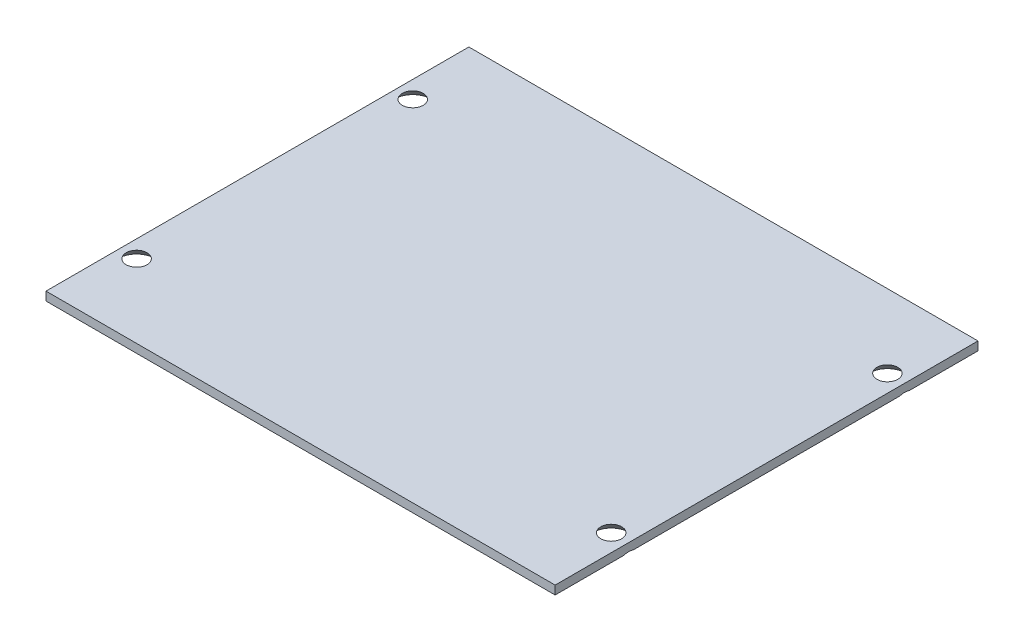
ISO-10303-21;
HEADER;
FILE_DESCRIPTION(('STEP AP214'),'2;1');
FILE_NAME('part.step','',(''),(''),'','','');
FILE_SCHEMA(('AUTOMOTIVE_DESIGN { 1 0 10303 214 1 1 1 1 }'));
ENDSEC;
DATA;
#1=APPLICATION_CONTEXT('core data for automotive mechanical design processes');
#2=APPLICATION_PROTOCOL_DEFINITION('international standard','automotive_design',2000,#1);
#3=PRODUCT_CONTEXT('',#1,'mechanical');
#4=PRODUCT('Part','Part','',(#3));
#5=PRODUCT_RELATED_PRODUCT_CATEGORY('part','',(#4));
#6=PRODUCT_DEFINITION_FORMATION('','',#4);
#7=PRODUCT_DEFINITION_CONTEXT('part definition',#1,'design');
#8=PRODUCT_DEFINITION('design','',#6,#7);
#9=PRODUCT_DEFINITION_SHAPE('','',#8);
#10=(LENGTH_UNIT() NAMED_UNIT(*) SI_UNIT(.MILLI.,.METRE.));
#11=(NAMED_UNIT(*) PLANE_ANGLE_UNIT() SI_UNIT($,.RADIAN.));
#12=(NAMED_UNIT(*) SI_UNIT($,.STERADIAN.) SOLID_ANGLE_UNIT());
#13=UNCERTAINTY_MEASURE_WITH_UNIT(LENGTH_MEASURE(1.E-05),#10,'distance_accuracy_value','');
#14=(GEOMETRIC_REPRESENTATION_CONTEXT(3) GLOBAL_UNCERTAINTY_ASSIGNED_CONTEXT((#13)) GLOBAL_UNIT_ASSIGNED_CONTEXT((#10,
#11,#12)) REPRESENTATION_CONTEXT('',''));
#15=CARTESIAN_POINT('',(0.,0.,0.));
#16=DIRECTION('',(0.,0.,1.));
#17=DIRECTION('',(1.,0.,0.));
#18=AXIS2_PLACEMENT_3D('',#15,#16,#17);
#19=CARTESIAN_POINT('',(0.,1.5875,0.));
#20=DIRECTION('',(0.,1.,0.));
#21=DIRECTION('',(0.,0.,1.));
#22=AXIS2_PLACEMENT_3D('',#19,#20,#21);
#23=PLANE('',#22);
#24=CARTESIAN_POINT('',(43.65625,1.5875,-25.4));
#25=DIRECTION('',(0.,1.,0.));
#26=DIRECTION('',(0.,0.,1.));
#27=AXIS2_PLACEMENT_3D('',#24,#25,#26);
#28=CIRCLE('',#27,1.91909900371674);
#29=CARTESIAN_POINT('',(43.65625,1.5875,-23.4809009962832));
#30=VERTEX_POINT('',#29);
#31=EDGE_CURVE('E109',#30,#30,#28,.T.);
#32=ORIENTED_EDGE('',*,*,#31,.F.);
#33=EDGE_LOOP('',(#32));
#34=FACE_BOUND('',#33,.T.);
#35=CARTESIAN_POINT('',(-43.65625,1.5875,-25.4000000000002));
#36=DIRECTION('',(0.,1.,0.));
#37=DIRECTION('',(0.,0.,1.));
#38=AXIS2_PLACEMENT_3D('',#35,#36,#37);
#39=CIRCLE('',#38,1.91909900371674);
#40=CARTESIAN_POINT('',(-43.65625,1.5875,-23.4809009962834));
#41=VERTEX_POINT('',#40);
#42=EDGE_CURVE('E115',#41,#41,#39,.T.);
#43=ORIENTED_EDGE('',*,*,#42,.F.);
#44=EDGE_LOOP('',(#43));
#45=FACE_BOUND('',#44,.T.);
#46=DIRECTION('',(0.,0.,-1.));
#47=VECTOR('',#46,1.);
#48=CARTESIAN_POINT('',(46.83125,1.5875,-38.89375));
#49=LINE('',#48,#47);
#50=CARTESIAN_POINT('',(46.83125,1.5875,38.89375));
#51=VERTEX_POINT('',#50);
#52=CARTESIAN_POINT('',(46.83125,1.5875,-38.89375));
#53=VERTEX_POINT('',#52);
#54=EDGE_CURVE('E128',#51,#53,#49,.T.);
#55=ORIENTED_EDGE('',*,*,#54,.T.);
#56=DIRECTION('',(-1.,0.,0.));
#57=VECTOR('',#56,1.);
#58=CARTESIAN_POINT('',(-46.83125,1.5875,-38.89375));
#59=LINE('',#58,#57);
#60=CARTESIAN_POINT('',(-46.83125,1.5875,-38.89375));
#61=VERTEX_POINT('',#60);
#62=EDGE_CURVE('E205',#53,#61,#59,.T.);
#63=ORIENTED_EDGE('',*,*,#62,.T.);
#64=DIRECTION('',(0.,0.,1.));
#65=VECTOR('',#64,1.);
#66=CARTESIAN_POINT('',(-46.83125,1.5875,-38.89375));
#67=LINE('',#66,#65);
#68=CARTESIAN_POINT('',(-46.83125,1.5875,38.89375));
#69=VERTEX_POINT('',#68);
#70=EDGE_CURVE('E206',#61,#69,#67,.T.);
#71=ORIENTED_EDGE('',*,*,#70,.T.);
#72=DIRECTION('',(1.,0.,0.));
#73=VECTOR('',#72,1.);
#74=CARTESIAN_POINT('',(-46.83125,1.5875,38.89375));
#75=LINE('',#74,#73);
#76=EDGE_CURVE('E118',#69,#51,#75,.T.);
#77=ORIENTED_EDGE('',*,*,#76,.T.);
#78=EDGE_LOOP('',(#55,#63,#71,#77));
#79=FACE_BOUND('',#78,.T.);
#80=CARTESIAN_POINT('',(-43.6562499999999,1.5875,25.3999999999998));
#81=DIRECTION('',(0.,1.,0.));
#82=DIRECTION('',(0.,0.,1.));
#83=AXIS2_PLACEMENT_3D('',#80,#81,#82);
#84=CIRCLE('',#83,1.91909900371674);
#85=CARTESIAN_POINT('',(-43.6562499999999,1.5875,27.3190990037166));
#86=VERTEX_POINT('',#85);
#87=EDGE_CURVE('E197',#86,#86,#84,.T.);
#88=ORIENTED_EDGE('',*,*,#87,.F.);
#89=EDGE_LOOP('',(#88));
#90=FACE_BOUND('',#89,.T.);
#91=CARTESIAN_POINT('',(43.6562499999999,1.5875,25.3999999999999));
#92=DIRECTION('',(0.,1.,0.));
#93=DIRECTION('',(0.,0.,1.));
#94=AXIS2_PLACEMENT_3D('',#91,#92,#93);
#95=CIRCLE('',#94,1.91909900371674);
#96=CARTESIAN_POINT('',(43.6562499999999,1.5875,27.3190990037167));
#97=VERTEX_POINT('',#96);
#98=EDGE_CURVE('E188',#97,#97,#95,.T.);
#99=ORIENTED_EDGE('',*,*,#98,.F.);
#100=EDGE_LOOP('',(#99));
#101=FACE_BOUND('',#100,.T.);
#102=ADVANCED_FACE('F33',(#34,#45,#79,#90,#101),#23,.T.);
#103=CARTESIAN_POINT('',(0.,0.,0.));
#104=DIRECTION('',(0.,1.,0.));
#105=DIRECTION('',(0.,0.,1.));
#106=AXIS2_PLACEMENT_3D('',#103,#104,#105);
#107=PLANE('',#106);
#108=DIRECTION('',(0.,0.,-1.));
#109=VECTOR('',#108,1.);
#110=CARTESIAN_POINT('',(46.83125,0.,-38.89375));
#111=LINE('',#110,#109);
#112=CARTESIAN_POINT('',(46.83125,0.,-26.2963152598327));
#113=VERTEX_POINT('',#112);
#114=CARTESIAN_POINT('',(46.83125,0.,-38.89375));
#115=VERTEX_POINT('',#114);
#116=EDGE_CURVE('E108',#113,#115,#111,.T.);
#117=ORIENTED_EDGE('',*,*,#116,.F.);
#118=CARTESIAN_POINT('',(43.65625,0.,-25.4));
#119=DIRECTION('',(0.,-1.,0.));
#120=DIRECTION('',(0.,0.,-1.));
#121=AXIS2_PLACEMENT_3D('',#118,#119,#120);
#122=CIRCLE('',#121,3.2990917);
#123=CARTESIAN_POINT('',(46.83125,0.,-24.5036847401672));
#124=VERTEX_POINT('',#123);
#125=EDGE_CURVE('E52',#124,#113,#122,.T.);
#126=ORIENTED_EDGE('',*,*,#125,.F.);
#127=CARTESIAN_POINT('',(46.83125,0.,24.5036847401676));
#128=VERTEX_POINT('',#127);
#129=EDGE_CURVE('E106',#128,#124,#111,.T.);
#130=ORIENTED_EDGE('',*,*,#129,.F.);
#131=CARTESIAN_POINT('',(43.6562499999999,0.,25.3999999999999));
#132=DIRECTION('',(0.,-1.,0.));
#133=DIRECTION('',(0.,0.,-1.));
#134=AXIS2_PLACEMENT_3D('',#131,#132,#133);
#135=CIRCLE('',#134,3.2990917);
#136=CARTESIAN_POINT('',(46.83125,0.,26.2963152598323));
#137=VERTEX_POINT('',#136);
#138=EDGE_CURVE('E58',#137,#128,#135,.T.);
#139=ORIENTED_EDGE('',*,*,#138,.F.);
#140=CARTESIAN_POINT('',(46.83125,0.,38.89375));
#141=VERTEX_POINT('',#140);
#142=EDGE_CURVE('E112',#141,#137,#111,.T.);
#143=ORIENTED_EDGE('',*,*,#142,.F.);
#144=DIRECTION('',(1.,0.,0.));
#145=VECTOR('',#144,1.);
#146=CARTESIAN_POINT('',(-46.83125,0.,38.89375));
#147=LINE('',#146,#145);
#148=CARTESIAN_POINT('',(-46.83125,0.,38.89375));
#149=VERTEX_POINT('',#148);
#150=EDGE_CURVE('E125',#149,#141,#147,.T.);
#151=ORIENTED_EDGE('',*,*,#150,.F.);
#152=DIRECTION('',(0.,0.,1.));
#153=VECTOR('',#152,1.);
#154=CARTESIAN_POINT('',(-46.83125,0.,-38.89375));
#155=LINE('',#154,#153);
#156=CARTESIAN_POINT('',(-46.83125,0.,26.2963152598323));
#157=VERTEX_POINT('',#156);
#158=EDGE_CURVE('E121',#157,#149,#155,.T.);
#159=ORIENTED_EDGE('',*,*,#158,.F.);
#160=CARTESIAN_POINT('',(-43.6562499999999,0.,25.3999999999998));
#161=DIRECTION('',(0.,-1.,0.));
#162=DIRECTION('',(0.,0.,-1.));
#163=AXIS2_PLACEMENT_3D('',#160,#161,#162);
#164=CIRCLE('',#163,3.2990917);
#165=CARTESIAN_POINT('',(-46.83125,0.,24.5036847401674));
#166=VERTEX_POINT('',#165);
#167=EDGE_CURVE('E191',#166,#157,#164,.T.);
#168=ORIENTED_EDGE('',*,*,#167,.F.);
#169=CARTESIAN_POINT('',(-46.83125,0.,-24.5036847401676));
#170=VERTEX_POINT('',#169);
#171=EDGE_CURVE('E126',#170,#166,#155,.T.);
#172=ORIENTED_EDGE('',*,*,#171,.F.);
#173=CARTESIAN_POINT('',(-43.65625,0.,-25.4000000000002));
#174=DIRECTION('',(0.,-1.,0.));
#175=DIRECTION('',(0.,0.,-1.));
#176=AXIS2_PLACEMENT_3D('',#173,#174,#175);
#177=CIRCLE('',#176,3.2990917);
#178=CARTESIAN_POINT('',(-46.83125,0.,-26.2963152598327));
#179=VERTEX_POINT('',#178);
#180=EDGE_CURVE('E200',#179,#170,#177,.T.);
#181=ORIENTED_EDGE('',*,*,#180,.F.);
#182=CARTESIAN_POINT('',(-46.83125,0.,-38.89375));
#183=VERTEX_POINT('',#182);
#184=EDGE_CURVE('E122',#183,#179,#155,.T.);
#185=ORIENTED_EDGE('',*,*,#184,.F.);
#186=DIRECTION('',(-1.,0.,0.));
#187=VECTOR('',#186,1.);
#188=CARTESIAN_POINT('',(-46.83125,0.,-38.89375));
#189=LINE('',#188,#187);
#190=EDGE_CURVE('E114',#115,#183,#189,.T.);
#191=ORIENTED_EDGE('',*,*,#190,.F.);
#192=EDGE_LOOP('',(#117,#126,#130,#139,#143,#151,#159,#168,#172,#181,#185,#191));
#193=FACE_BOUND('',#192,.T.);
#194=ADVANCED_FACE('F105',(#193),#107,.F.);
#195=CARTESIAN_POINT('',(46.83125,1.5875,-38.89375));
#196=DIRECTION('',(-1.,0.,0.));
#197=DIRECTION('',(0.,0.,1.));
#198=AXIS2_PLACEMENT_3D('',#195,#196,#197);
#199=PLANE('',#198);
#200=ORIENTED_EDGE('',*,*,#129,.T.);
#201=CARTESIAN_POINT('',(46.83125,-6.6615347098854,-33.9173476613225));
#202=CARTESIAN_POINT('',(46.83125,-6.45363615692985,-33.7244566383804));
#203=CARTESIAN_POINT('',(46.83125,-6.2461163738843,-33.5311550001084));
#204=CARTESIAN_POINT('',(46.83125,-5.83204807274289,-33.1434931417901));
#205=CARTESIAN_POINT('',(46.83125,-5.62549960565082,-32.9491328672863));
#206=CARTESIAN_POINT('',(46.83125,-5.21304518780103,-32.5586022441624));
#207=CARTESIAN_POINT('',(46.83125,-5.00714254671966,-32.3624283957492));
#208=CARTESIAN_POINT('',(46.83125,-4.59688572014866,-31.9684791969045));
#209=CARTESIAN_POINT('',(46.83125,-4.39253148798032,-31.7707038951258));
#210=CARTESIAN_POINT('',(46.83125,-3.96463512971957,-31.3524120392372));
#211=CARTESIAN_POINT('',(46.83125,-3.7413108844339,-31.1316719997029));
#212=CARTESIAN_POINT('',(46.83125,-3.29795946249871,-30.6868544565887));
#213=CARTESIAN_POINT('',(46.83125,-3.07793262188637,-30.4627766174326));
#214=CARTESIAN_POINT('',(46.83125,-2.6428953185707,-30.0104186869752));
#215=CARTESIAN_POINT('',(46.83125,-2.4278777893509,-29.7821454446736));
#216=CARTESIAN_POINT('',(46.83125,-2.11064603311035,-29.4349298566036));
#217=CARTESIAN_POINT('',(46.83125,-2.00579280773004,-29.3183999969538));
#218=CARTESIAN_POINT('',(46.83125,-1.79830205901468,-29.0833873681014));
#219=CARTESIAN_POINT('',(46.83125,-1.69566442224719,-28.9649046994281));
#220=CARTESIAN_POINT('',(46.83125,-1.51664063283515,-28.753272871541));
#221=CARTESIAN_POINT('',(46.83125,-1.43967932295625,-28.6606108111586));
#222=CARTESIAN_POINT('',(46.83125,-1.28777648117892,-28.4736370010887));
#223=CARTESIAN_POINT('',(46.83125,-1.21283499998047,-28.3793252100891));
#224=CARTESIAN_POINT('',(46.83125,-1.06531279583779,-28.1886007411444));
#225=CARTESIAN_POINT('',(46.83125,-0.992736464821353,-28.0921846545072));
#226=CARTESIAN_POINT('',(46.83125,-0.850707863565356,-27.8970742704898));
#227=CARTESIAN_POINT('',(46.83125,-0.781255451625916,-27.7983800767517));
#228=CARTESIAN_POINT('',(46.83125,-0.647654810552132,-27.6003218882064));
#229=CARTESIAN_POINT('',(46.83125,-0.583428071352247,-27.5010111476961));
#230=CARTESIAN_POINT('',(46.83125,-0.459790515990772,-27.2993785381575));
#231=CARTESIAN_POINT('',(46.83125,-0.400380870024767,-27.1970559456526));
#232=CARTESIAN_POINT('',(46.83125,-0.287948819109812,-26.9893400055146));
#233=CARTESIAN_POINT('',(46.83125,-0.234907169049909,-26.8839571701407));
#234=CARTESIAN_POINT('',(46.83125,-0.13679147404556,-26.6695568997336));
#235=CARTESIAN_POINT('',(46.83125,-0.091712652615975,-26.5605416905444));
#236=CARTESIAN_POINT('',(46.83125,-0.0225785712868721,-26.3690840562381));
#237=CARTESIAN_POINT('',(46.83125,0.00385730997155044,-26.2875040648614));
#238=CARTESIAN_POINT('',(46.83125,0.0504928951866644,-26.1225524455055));
#239=CARTESIAN_POINT('',(46.83125,0.0706922821769782,-26.039180726693));
#240=CARTESIAN_POINT('',(46.83125,0.103946090418744,-25.8713234622767));
#241=CARTESIAN_POINT('',(46.83125,0.117026374725959,-25.7868431059206));
#242=CARTESIAN_POINT('',(46.83125,0.135517992709547,-25.6170401100945));
#243=CARTESIAN_POINT('',(46.83125,0.14092975587248,-25.5317175180646));
#244=CARTESIAN_POINT('',(46.83125,0.143834091354353,-25.3586075881522));
#245=CARTESIAN_POINT('',(46.83125,0.141106907590772,-25.270816427227));
#246=CARTESIAN_POINT('',(46.83125,0.127409132276347,-25.0958871113074));
#247=CARTESIAN_POINT('',(46.83125,0.116438167359578,-25.0087489860699));
#248=CARTESIAN_POINT('',(46.83125,0.0867820697105784,-24.8354760125279));
#249=CARTESIAN_POINT('',(46.83125,0.0680681001930258,-24.7493461655604));
#250=CARTESIAN_POINT('',(46.83125,0.0237925396516435,-24.5788766330384));
#251=CARTESIAN_POINT('',(46.83125,-0.00177030821238226,-24.4945372791266));
#252=CARTESIAN_POINT('',(46.83125,-0.0749920962627691,-24.2804675559916));
#253=CARTESIAN_POINT('',(46.83125,-0.126948430817452,-24.1522084677502));
#254=CARTESIAN_POINT('',(46.83125,-0.241809634138805,-23.9007091131845));
#255=CARTESIAN_POINT('',(46.83125,-0.304722792386202,-23.7774727345781));
#256=CARTESIAN_POINT('',(46.83125,-0.439336891048085,-23.5343611110892));
#257=CARTESIAN_POINT('',(46.83125,-0.511117934642441,-23.414530660129));
#258=CARTESIAN_POINT('',(46.83125,-0.623404253703908,-23.2377967077546));
#259=CARTESIAN_POINT('',(46.83125,-0.661595097567954,-23.1793972557158));
#260=CARTESIAN_POINT('',(46.83125,-0.739326016281326,-23.0635060762416));
#261=CARTESIAN_POINT('',(46.83125,-0.778866027521079,-23.0060143061979));
#262=CARTESIAN_POINT('',(46.83125,-0.917365540088367,-22.8089830811924));
#263=CARTESIAN_POINT('',(46.83125,-1.01925348725397,-22.6714995054056));
#264=CARTESIAN_POINT('',(46.83125,-1.22811925319837,-22.4004386147556));
#265=CARTESIAN_POINT('',(46.83125,-1.33509847736855,-22.2668623950984));
#266=CARTESIAN_POINT('',(46.83125,-1.55293891781131,-22.0027312412435));
#267=CARTESIAN_POINT('',(46.83125,-1.66380340416188,-21.8721790135412));
#268=CARTESIAN_POINT('',(46.83125,-1.88843511004277,-21.6135896837555));
#269=CARTESIAN_POINT('',(46.83125,-2.00220254379247,-21.4855527685276));
#270=CARTESIAN_POINT('',(46.83125,-2.23246375811113,-21.2310089562714));
#271=CARTESIAN_POINT('',(46.83125,-2.34896675944993,-21.1045104203233));
#272=CARTESIAN_POINT('',(46.83125,-2.5837862863134,-20.8532057130437));
#273=CARTESIAN_POINT('',(46.83125,-2.70210285931229,-20.7283995861765));
#274=CARTESIAN_POINT('',(46.83125,-3.05909786378514,-20.3562039103549));
#275=CARTESIAN_POINT('',(46.83125,-3.29994838116391,-20.1108985287273));
#276=CARTESIAN_POINT('',(46.83125,-3.75912205639183,-19.6507048258377));
#277=CARTESIAN_POINT('',(46.83125,-3.9770429350039,-19.4354126088206));
#278=CARTESIAN_POINT('',(46.83125,-4.41522536945372,-19.0071590706966));
#279=CARTESIAN_POINT('',(46.83125,-4.63548727145447,-18.7941981040311));
#280=CARTESIAN_POINT('',(46.83125,-5.07590875217731,-18.371864494898));
#281=CARTESIAN_POINT('',(46.83125,-5.29605386810993,-18.1624767384781));
#282=CARTESIAN_POINT('',(46.83125,-5.73765683814651,-17.7451761917981));
#283=CARTESIAN_POINT('',(46.83125,-5.95911442690909,-17.537263120899));
#284=CARTESIAN_POINT('',(46.83125,-6.1810714429872,-17.329889079057));
#285=B_SPLINE_CURVE_WITH_KNOTS('',3,(#201,#202,#203,#204,#205,#206,#207,#208,#209,#210,#211,
#212,#213,#214,#215,#216,#217,#218,#219,#220,#221,#222,#223,#224,#225,#226,#227,#228,#229,#230,
#231,#232,#233,#234,#235,#236,#237,#238,#239,#240,#241,#242,#243,#244,#245,#246,#247,#248,#249,
#250,#251,#252,#253,#254,#255,#256,#257,#258,#259,#260,#261,#262,#263,#264,#265,#266,#267,#268,
#269,#270,#271,#272,#273,#274,#275,#276,#277,#278,#279,#280,#281,#282,#283,#284),.UNSPECIFIED.,
.F.,.F.,(4,2,2,2,2,2,2,2,2,2,2,2,2,2,2,2,2,2,2,2,2,2,2,2,2,2,2,2,2,2,2,2,2,2,2,2,2,2,2,2,2,4),
(0.,0.850800759157124,1.70164570587839,2.55482124761317,3.40797096614949,4.34996250983538,
5.29204940749354,6.23271516763527,6.70297194879554,7.17320459664228,7.53454568969602,
7.89589584438788,8.25788264369243,8.61985300680923,8.97455418002674,9.32934126270483,
9.68302758641352,10.0365010263356,10.2935620084559,10.5506360534088,10.8067698295799,
11.0628892600433,11.3259860604266,11.5890947773444,11.8531923216633,12.1173383638548,
12.5317468144974,12.9464701623662,13.3652591766664,13.5745807662025,13.7838925003943,
14.2970730685617,14.8103961257016,15.3241621242184,15.8379661457297,16.353863943165,
16.8697752684995,17.9010346628662,18.8200170721562,19.7391373145184,20.6505931963532,
21.5618707015222),.UNSPECIFIED.);
#286=EDGE_CURVE('E11',#124,#113,#285,.F.);
#287=ORIENTED_EDGE('',*,*,#286,.T.);
#288=ORIENTED_EDGE('',*,*,#116,.T.);
#289=DIRECTION('',(0.,-1.,0.));
#290=VECTOR('',#289,1.);
#291=CARTESIAN_POINT('',(46.83125,1.5875,-38.89375));
#292=LINE('',#291,#290);
#293=EDGE_CURVE('E138',#53,#115,#292,.T.);
#294=ORIENTED_EDGE('',*,*,#293,.F.);
#295=ORIENTED_EDGE('',*,*,#54,.F.);
#296=DIRECTION('',(0.,-1.,0.));
#297=VECTOR('',#296,1.);
#298=CARTESIAN_POINT('',(46.83125,1.5875,38.89375));
#299=LINE('',#298,#297);
#300=EDGE_CURVE('E129',#51,#141,#299,.T.);
#301=ORIENTED_EDGE('',*,*,#300,.T.);
#302=ORIENTED_EDGE('',*,*,#142,.T.);
#303=CARTESIAN_POINT('',(46.83125,-6.66153473769248,16.8826523128803));
#304=CARTESIAN_POINT('',(46.83125,-6.45363618379886,17.0755433366215));
#305=CARTESIAN_POINT('',(46.83125,-6.24611639981514,17.2688449756926));
#306=CARTESIAN_POINT('',(46.83125,-5.83204809679753,17.6565068356098));
#307=CARTESIAN_POINT('',(46.83125,-5.62549962876744,17.8508671109134));
#308=CARTESIAN_POINT('',(46.83125,-5.21304520903879,18.241397735641));
#309=CARTESIAN_POINT('',(46.83125,-5.00714256701659,18.4375715848583));
#310=CARTESIAN_POINT('',(46.83125,-4.59688573856536,18.8315207853131));
#311=CARTESIAN_POINT('',(46.83125,-4.39253150545761,19.029296087898));
#312=CARTESIAN_POINT('',(46.83125,-3.96463514516201,19.4475879455464));
#313=CARTESIAN_POINT('',(46.83125,-3.74131089878183,19.6683279860355));
#314=CARTESIAN_POINT('',(46.83125,-3.29795947466586,20.11314553107));
#315=CARTESIAN_POINT('',(46.83125,-3.07793263296724,20.3372233711915));
#316=CARTESIAN_POINT('',(46.83125,-2.6428953274973,20.7895813035958));
#317=CARTESIAN_POINT('',(46.83125,-2.42787779720946,21.0178545468788));
#318=CARTESIAN_POINT('',(46.83125,-2.11064603939103,21.3650701364459));
#319=CARTESIAN_POINT('',(46.83125,-2.00579281348888,21.4815999965989));
#320=CARTESIAN_POINT('',(46.83125,-1.7983020637416,21.716612626469));
#321=CARTESIAN_POINT('',(46.83125,-1.69566442646403,21.8350952956571));
#322=CARTESIAN_POINT('',(46.83125,-1.51664063641768,22.0467271241702));
#323=CARTESIAN_POINT('',(46.83125,-1.43967932640563,22.1393891846561));
#324=CARTESIAN_POINT('',(46.83125,-1.28777648436153,22.3263629949335));
#325=CARTESIAN_POINT('',(46.83125,-1.21283500302947,22.4206747860373));
#326=CARTESIAN_POINT('',(46.83125,-1.06531279861887,22.6113992551918));
#327=CARTESIAN_POINT('',(46.83125,-0.992736467468143,22.7078153419347));
#328=CARTESIAN_POINT('',(46.83125,-0.850707865943654,22.9029257261652));
#329=CARTESIAN_POINT('',(46.83125,-0.781255453870013,23.0016199200109));
#330=CARTESIAN_POINT('',(46.83125,-0.647654812531139,23.1996781087723));
#331=CARTESIAN_POINT('',(46.83125,-0.583428073200361,23.2989888493911));
#332=CARTESIAN_POINT('',(46.83125,-0.459790517579149,23.5006214591511));
#333=CARTESIAN_POINT('',(46.83125,-0.400380871484303,23.6029440517688));
#334=CARTESIAN_POINT('',(46.83125,-0.287948820316611,23.8106599921386));
#335=CARTESIAN_POINT('',(46.83125,-0.234907170132796,23.9160428276313));
#336=CARTESIAN_POINT('',(46.83125,-0.136791474889453,24.1304430982846));
#337=CARTESIAN_POINT('',(46.83125,-0.0917126533447776,24.2394583076014));
#338=CARTESIAN_POINT('',(46.83125,-0.0225785717784564,24.4309159422817));
#339=CARTESIAN_POINT('',(46.83125,0.00385730959624607,24.5124959339058));
#340=CARTESIAN_POINT('',(46.83125,0.0504928950080065,24.6774475537688));
#341=CARTESIAN_POINT('',(46.83125,0.0706922820786872,24.760819272841));
#342=CARTESIAN_POINT('',(46.83125,0.103946090436112,24.9286765377821));
#343=CARTESIAN_POINT('',(46.83125,0.117026374779051,25.0131568944031));
#344=CARTESIAN_POINT('',(46.83125,0.135517992784818,25.1829598907627));
#345=CARTESIAN_POINT('',(46.83125,0.140929755934242,25.2682824830611));
#346=CARTESIAN_POINT('',(46.83125,0.143834091330152,25.4413924130454));
#347=CARTESIAN_POINT('',(46.83125,0.141106907537613,25.5291835737729));
#348=CARTESIAN_POINT('',(46.83125,0.12740913220351,25.7041128892978));
#349=CARTESIAN_POINT('',(46.83125,0.116438167296051,25.7912510143382));
#350=CARTESIAN_POINT('',(46.83125,0.0867820697008779,25.9645239874899));
#351=CARTESIAN_POINT('',(46.83125,0.0680681002280601,26.0506538342641));
#352=CARTESIAN_POINT('',(46.83125,0.0237925398056048,26.2211233664083));
#353=CARTESIAN_POINT('',(46.83125,-0.00177030798422045,26.3054627201354));
#354=CARTESIAN_POINT('',(46.83125,-0.0749920958892208,26.5195324430264));
#355=CARTESIAN_POINT('',(46.83125,-0.126948430380183,26.6477915312072));
#356=CARTESIAN_POINT('',(46.83125,-0.241809633570917,26.8992908856567));
#357=CARTESIAN_POINT('',(46.83125,-0.304722791751433,27.0225272642076));
#358=CARTESIAN_POINT('',(46.83125,-0.439336890278414,27.2656388875887));
#359=CARTESIAN_POINT('',(46.83125,-0.511117933804794,27.3854693384968));
#360=CARTESIAN_POINT('',(46.83125,-0.623404252764421,27.5622032907941));
#361=CARTESIAN_POINT('',(46.83125,-0.661595096594539,27.6206027428074));
#362=CARTESIAN_POINT('',(46.83125,-0.739326015240149,27.736493922231));
#363=CARTESIAN_POINT('',(46.83125,-0.778866026446068,27.7939856922496));
#364=CARTESIAN_POINT('',(46.83125,-0.917365538809038,27.9910169170438));
#365=CARTESIAN_POINT('',(46.83125,-1.01925348579826,28.1285004926495));
#366=CARTESIAN_POINT('',(46.83125,-1.22811925138328,28.3995613829439));
#367=CARTESIAN_POINT('',(46.83125,-1.33509847537046,28.5331376024267));
#368=CARTESIAN_POINT('',(46.83125,-1.55293891544312,28.7972687559369));
#369=CARTESIAN_POINT('',(46.83125,-1.66380340160657,28.927820983469));
#370=CARTESIAN_POINT('',(46.83125,-1.88843510711093,29.1864103129172));
#371=CARTESIAN_POINT('',(46.83125,-2.0022025406712,29.3144472279779));
#372=CARTESIAN_POINT('',(46.83125,-2.23246375460889,29.5689910399009));
#373=CARTESIAN_POINT('',(46.83125,-2.34896675575616,29.6954895756832));
#374=CARTESIAN_POINT('',(46.83125,-2.58378628223573,29.9467942826323));
#375=CARTESIAN_POINT('',(46.83125,-2.70210285504223,30.071600409335));
#376=CARTESIAN_POINT('',(46.83125,-3.05909785893754,30.4437960846645));
#377=CARTESIAN_POINT('',(46.83125,-3.29994837593045,30.6891014659658));
#378=CARTESIAN_POINT('',(46.83125,-3.75912205045106,31.1492951682626));
#379=CARTESIAN_POINT('',(46.83125,-3.97704292874206,31.3645873850127));
#380=CARTESIAN_POINT('',(46.83125,-4.41522536255016,31.7928409226026));
#381=CARTESIAN_POINT('',(46.83125,-4.63548726423023,32.0058018890012));
#382=CARTESIAN_POINT('',(46.83125,-5.07590874431406,32.4281354976014));
#383=CARTESIAN_POINT('',(46.83125,-5.29605385992833,32.6375232537554));
#384=CARTESIAN_POINT('',(46.83125,-5.73765682932875,33.0548237999035));
#385=CARTESIAN_POINT('',(46.83125,-5.95911441777354,33.2627368705366));
#386=CARTESIAN_POINT('',(46.83125,-6.18107143353408,33.4701109121123));
#387=B_SPLINE_CURVE_WITH_KNOTS('',3,(#303,#304,#305,#306,#307,#308,#309,#310,#311,#312,#313,
#314,#315,#316,#317,#318,#319,#320,#321,#322,#323,#324,#325,#326,#327,#328,#329,#330,#331,#332,
#333,#334,#335,#336,#337,#338,#339,#340,#341,#342,#343,#344,#345,#346,#347,#348,#349,#350,#351,
#352,#353,#354,#355,#356,#357,#358,#359,#360,#361,#362,#363,#364,#365,#366,#367,#368,#369,#370,
#371,#372,#373,#374,#375,#376,#377,#378,#379,#380,#381,#382,#383,#384,#385,#386),.UNSPECIFIED.,
.F.,.F.,(4,2,2,2,2,2,2,2,2,2,2,2,2,2,2,2,2,2,2,2,2,2,2,2,2,2,2,2,2,2,2,2,2,2,2,2,2,2,2,2,2,4),
(0.,0.850800762850608,1.70164571326558,2.55482125870764,3.407970980951,4.34996252898575,
5.29204943099372,6.23271519547505,6.70297197880434,7.17320462881986,7.53454572236758,
7.89589587755346,8.25788267735365,8.61985304096603,8.97455421467014,9.3293412978351,
9.68302762202904,10.0365010624359,10.2935620453679,10.5506360911325,10.8067698681024,
11.0628892993634,11.32598609916,11.5890948154901,11.8531923592161,12.1173384008145,
12.531746851217,12.9464701988462,13.3652592129071,13.5745808023236,13.7838925363957,
14.2970731038119,14.8103961602002,15.3241621579644,15.8379661787231,16.3538639754031,
16.8697752999823,17.9010346928396,18.8200171008814,19.7391373419951,20.6505932225882,
21.5618707265158),.UNSPECIFIED.);
#388=EDGE_CURVE('E46',#137,#128,#387,.F.);
#389=ORIENTED_EDGE('',*,*,#388,.T.);
#390=EDGE_LOOP('',(#200,#287,#288,#294,#295,#301,#302,#389));
#391=FACE_BOUND('',#390,.T.);
#392=ADVANCED_FACE('F35',(#391),#199,.F.);
#393=CARTESIAN_POINT('',(-46.83125,1.5875,-38.89375));
#394=DIRECTION('',(0.,0.,1.));
#395=DIRECTION('',(1.,0.,0.));
#396=AXIS2_PLACEMENT_3D('',#393,#394,#395);
#397=PLANE('',#396);
#398=ORIENTED_EDGE('',*,*,#190,.T.);
#399=DIRECTION('',(0.,-1.,0.));
#400=VECTOR('',#399,1.);
#401=CARTESIAN_POINT('',(-46.83125,1.5875,-38.89375));
#402=LINE('',#401,#400);
#403=EDGE_CURVE('E135',#61,#183,#402,.T.);
#404=ORIENTED_EDGE('',*,*,#403,.F.);
#405=ORIENTED_EDGE('',*,*,#62,.F.);
#406=ORIENTED_EDGE('',*,*,#293,.T.);
#407=EDGE_LOOP('',(#398,#404,#405,#406));
#408=FACE_BOUND('',#407,.T.);
#409=ADVANCED_FACE('F177',(#408),#397,.F.);
#410=CARTESIAN_POINT('',(-46.83125,1.5875,-38.89375));
#411=DIRECTION('',(1.,0.,0.));
#412=DIRECTION('',(0.,0.,-1.));
#413=AXIS2_PLACEMENT_3D('',#410,#411,#412);
#414=PLANE('',#413);
#415=ORIENTED_EDGE('',*,*,#171,.T.);
#416=CARTESIAN_POINT('',(-46.83125,-6.66153470988528,16.8826523386774));
#417=CARTESIAN_POINT('',(-46.83125,-6.45363615692974,17.0755433616196));
#418=CARTESIAN_POINT('',(-46.83125,-6.24611637388421,17.2688449998916));
#419=CARTESIAN_POINT('',(-46.83125,-5.83204807274281,17.6565068582098));
#420=CARTESIAN_POINT('',(-46.83125,-5.62549960565075,17.8508671327136));
#421=CARTESIAN_POINT('',(-46.83125,-5.21304518780098,18.2413977558375));
#422=CARTESIAN_POINT('',(-46.83125,-5.00714254671962,18.4375716042507));
#423=CARTESIAN_POINT('',(-46.83125,-4.59688572014864,18.8315208030953));
#424=CARTESIAN_POINT('',(-46.83125,-4.3925314879803,19.0292961048741));
#425=CARTESIAN_POINT('',(-46.83125,-3.96463512971958,19.4475879607627));
#426=CARTESIAN_POINT('',(-46.83125,-3.74131088443392,19.6683280002969));
#427=CARTESIAN_POINT('',(-46.83125,-3.29795946249875,20.1131455434111));
#428=CARTESIAN_POINT('',(-46.83125,-3.07793262188642,20.3372233825672));
#429=CARTESIAN_POINT('',(-46.83125,-2.64289531857078,20.7895813130246));
#430=CARTESIAN_POINT('',(-46.83125,-2.42787778935099,21.0178545553262));
#431=CARTESIAN_POINT('',(-46.83125,-2.11064603311045,21.3650701433961));
#432=CARTESIAN_POINT('',(-46.83125,-2.00579280773015,21.481600003046));
#433=CARTESIAN_POINT('',(-46.83125,-1.79830205901479,21.7166126318983));
#434=CARTESIAN_POINT('',(-46.83125,-1.69566442224731,21.8350953005717));
#435=CARTESIAN_POINT('',(-46.83125,-1.51664063283527,22.0467271284587));
#436=CARTESIAN_POINT('',(-46.83125,-1.43967932295636,22.1393891888412));
#437=CARTESIAN_POINT('',(-46.83125,-1.28777648117903,22.326362998911));
#438=CARTESIAN_POINT('',(-46.83125,-1.21283499998058,22.4206747899107));
#439=CARTESIAN_POINT('',(-46.83125,-1.06531279583789,22.6113992588554));
#440=CARTESIAN_POINT('',(-46.83125,-0.992736464821449,22.7078153454926));
#441=CARTESIAN_POINT('',(-46.83125,-0.850707863565447,22.90292572951));
#442=CARTESIAN_POINT('',(-46.83125,-0.781255451626005,23.0016199232481));
#443=CARTESIAN_POINT('',(-46.83125,-0.647654810552217,23.1996781117934));
#444=CARTESIAN_POINT('',(-46.83125,-0.58342807135233,23.2989888523037));
#445=CARTESIAN_POINT('',(-46.83125,-0.459790515990853,23.5006214618423));
#446=CARTESIAN_POINT('',(-46.83125,-0.400380870024847,23.6029440543472));
#447=CARTESIAN_POINT('',(-46.83125,-0.287948819109891,23.8106599944853));
#448=CARTESIAN_POINT('',(-46.83125,-0.234907169049988,23.9160428298592));
#449=CARTESIAN_POINT('',(-46.83125,-0.136791474045639,24.1304431002662));
#450=CARTESIAN_POINT('',(-46.83125,-0.0917126526160536,24.2394583094555));
#451=CARTESIAN_POINT('',(-46.83125,-0.0225785712869521,24.4309159437617));
#452=CARTESIAN_POINT('',(-46.83125,0.00385730997146942,24.5124959351385));
#453=CARTESIAN_POINT('',(-46.83125,0.0504928951865818,24.6774475544944));
#454=CARTESIAN_POINT('',(-46.83125,0.0706922821768949,24.7608192733068));
#455=CARTESIAN_POINT('',(-46.83125,0.103946090418658,24.9286765377232));
#456=CARTESIAN_POINT('',(-46.83125,0.117026374725872,25.0131568940793));
#457=CARTESIAN_POINT('',(-46.83125,0.135517992709456,25.1829598899054));
#458=CARTESIAN_POINT('',(-46.83125,0.140929755872388,25.2682824819352));
#459=CARTESIAN_POINT('',(-46.83125,0.143834091354258,25.4413924118476));
#460=CARTESIAN_POINT('',(-46.83125,0.141106907590675,25.5291835727728));
#461=CARTESIAN_POINT('',(-46.83125,0.127409132276247,25.7041128886924));
#462=CARTESIAN_POINT('',(-46.83125,0.116438167359476,25.7912510139299));
#463=CARTESIAN_POINT('',(-46.83125,0.0867820697104742,25.964523987472));
#464=CARTESIAN_POINT('',(-46.83125,0.0680681001929205,26.0506538344394));
#465=CARTESIAN_POINT('',(-46.83125,0.023792539651536,26.2211233669615));
#466=CARTESIAN_POINT('',(-46.83125,-0.0017703082124908,26.3054627208732));
#467=CARTESIAN_POINT('',(-46.83125,-0.0749920962628817,26.5195324440083));
#468=CARTESIAN_POINT('',(-46.83125,-0.126948430817568,26.6477915322497));
#469=CARTESIAN_POINT('',(-46.83125,-0.241809634138928,26.8992908868154));
#470=CARTESIAN_POINT('',(-46.83125,-0.304722792386329,27.0225272654218));
#471=CARTESIAN_POINT('',(-46.83125,-0.439336891048219,27.2656388889107));
#472=CARTESIAN_POINT('',(-46.83125,-0.511117934642579,27.3854693398709));
#473=CARTESIAN_POINT('',(-46.83125,-0.623404253704053,27.5622032922453));
#474=CARTESIAN_POINT('',(-46.83125,-0.661595097568102,27.6206027442841));
#475=CARTESIAN_POINT('',(-46.83125,-0.739326016281479,27.7364939237583));
#476=CARTESIAN_POINT('',(-46.83125,-0.778866027521235,27.793985693802));
#477=CARTESIAN_POINT('',(-46.83125,-0.917365540088533,27.9910169188075));
#478=CARTESIAN_POINT('',(-46.83125,-1.01925348725415,28.1285004945943));
#479=CARTESIAN_POINT('',(-46.83125,-1.22811925319856,28.3995613852444));
#480=CARTESIAN_POINT('',(-46.83125,-1.33509847736875,28.5331376049016));
#481=CARTESIAN_POINT('',(-46.83125,-1.55293891781153,28.7972687587565));
#482=CARTESIAN_POINT('',(-46.83125,-1.6638034041621,28.9278209864588));
#483=CARTESIAN_POINT('',(-46.83125,-1.88843511004301,29.1864103162445));
#484=CARTESIAN_POINT('',(-46.83125,-2.00220254379272,29.3144472314725));
#485=CARTESIAN_POINT('',(-46.83125,-2.23246375811139,29.5689910437286));
#486=CARTESIAN_POINT('',(-46.83125,-2.34896675945021,29.6954895796768));
#487=CARTESIAN_POINT('',(-46.83125,-2.5837862863137,29.9467942869564));
#488=CARTESIAN_POINT('',(-46.83125,-2.70210285931259,30.0716004138236));
#489=CARTESIAN_POINT('',(-46.83125,-3.05909786378547,30.4437960896452));
#490=CARTESIAN_POINT('',(-46.83125,-3.29994838116426,30.6891014712728));
#491=CARTESIAN_POINT('',(-46.83125,-3.75912205639222,31.1492951741624));
#492=CARTESIAN_POINT('',(-46.83125,-3.9770429350043,31.3645873911796));
#493=CARTESIAN_POINT('',(-46.83125,-4.41522536945416,31.7928409293035));
#494=CARTESIAN_POINT('',(-46.83125,-4.63548727145492,32.0058018959692));
#495=CARTESIAN_POINT('',(-46.83125,-5.0759087521778,32.4281355051023));
#496=CARTESIAN_POINT('',(-46.83125,-5.29605386811043,32.6375232615221));
#497=CARTESIAN_POINT('',(-46.83125,-5.73765683814704,33.0548238082022));
#498=CARTESIAN_POINT('',(-46.83125,-5.95911442690965,33.2627368791013));
#499=CARTESIAN_POINT('',(-46.83125,-6.18107144298777,33.4701109209433));
#500=B_SPLINE_CURVE_WITH_KNOTS('',3,(#416,#417,#418,#419,#420,#421,#422,#423,#424,#425,#426,
#427,#428,#429,#430,#431,#432,#433,#434,#435,#436,#437,#438,#439,#440,#441,#442,#443,#444,#445,
#446,#447,#448,#449,#450,#451,#452,#453,#454,#455,#456,#457,#458,#459,#460,#461,#462,#463,#464,
#465,#466,#467,#468,#469,#470,#471,#472,#473,#474,#475,#476,#477,#478,#479,#480,#481,#482,#483,
#484,#485,#486,#487,#488,#489,#490,#491,#492,#493,#494,#495,#496,#497,#498,#499),.UNSPECIFIED.,
.F.,.F.,(4,2,2,2,2,2,2,2,2,2,2,2,2,2,2,2,2,2,2,2,2,2,2,2,2,2,2,2,2,2,2,2,2,2,2,2,2,2,2,2,2,4),
(0.,0.850800759157087,1.70164570587831,2.55482124761306,3.40797096614934,4.34996250983518,
5.29204940749329,6.23271516763499,6.70297194879524,7.17320459664196,7.53454568969572,
7.89589584438759,8.25788264369216,8.61985300680898,8.97455418002649,9.3293412627046,
9.6830275864133,10.0365010263354,10.2935620084557,10.5506360534086,10.8067698295797,
11.0628892600431,11.3259860604265,11.5890947773443,11.8531923216631,12.1173383638546,
12.5317468144973,12.946470162366,13.3652591766662,13.5745807662024,13.7838925003942,
14.2970730685617,14.8103961257016,15.3241621242184,15.8379661457297,16.353863943165,
16.8697752684996,17.9010346628664,18.8200170721565,19.7391373145188,20.6505931963536,
21.5618707015227),.UNSPECIFIED.);
#501=EDGE_CURVE('E149',#166,#157,#500,.T.);
#502=ORIENTED_EDGE('',*,*,#501,.T.);
#503=ORIENTED_EDGE('',*,*,#158,.T.);
#504=DIRECTION('',(0.,-1.,0.));
#505=VECTOR('',#504,1.);
#506=CARTESIAN_POINT('',(-46.83125,1.5875,38.89375));
#507=LINE('',#506,#505);
#508=EDGE_CURVE('E132',#69,#149,#507,.T.);
#509=ORIENTED_EDGE('',*,*,#508,.F.);
#510=ORIENTED_EDGE('',*,*,#70,.F.);
#511=ORIENTED_EDGE('',*,*,#403,.T.);
#512=ORIENTED_EDGE('',*,*,#184,.T.);
#513=CARTESIAN_POINT('',(-46.83125,-6.66153470988529,-33.9173476613226));
#514=CARTESIAN_POINT('',(-46.83125,-6.45363615692975,-33.7244566383805));
#515=CARTESIAN_POINT('',(-46.83125,-6.24611637388421,-33.5311550001085));
#516=CARTESIAN_POINT('',(-46.83125,-5.83204807274281,-33.1434931417902));
#517=CARTESIAN_POINT('',(-46.83125,-5.62549960565075,-32.9491328672864));
#518=CARTESIAN_POINT('',(-46.83125,-5.21304518780098,-32.5586022441625));
#519=CARTESIAN_POINT('',(-46.83125,-5.00714254671961,-32.3624283957493));
#520=CARTESIAN_POINT('',(-46.83125,-4.59688572014863,-31.9684791969047));
#521=CARTESIAN_POINT('',(-46.83125,-4.39253148798029,-31.7707038951259));
#522=CARTESIAN_POINT('',(-46.83125,-3.96463512971956,-31.3524120392374));
#523=CARTESIAN_POINT('',(-46.83125,-3.7413108844339,-31.1316719997031));
#524=CARTESIAN_POINT('',(-46.83125,-3.29795946249874,-30.6868544565889));
#525=CARTESIAN_POINT('',(-46.83125,-3.07793262188641,-30.4627766174328));
#526=CARTESIAN_POINT('',(-46.83125,-2.64289531857076,-30.0104186869754));
#527=CARTESIAN_POINT('',(-46.83125,-2.42787778935097,-29.7821454446738));
#528=CARTESIAN_POINT('',(-46.83125,-2.11064603311043,-29.4349298566039));
#529=CARTESIAN_POINT('',(-46.83125,-2.00579280773012,-29.318399996954));
#530=CARTESIAN_POINT('',(-46.83125,-1.79830205901476,-29.0833873681017));
#531=CARTESIAN_POINT('',(-46.83125,-1.69566442224728,-28.9649046994283));
#532=CARTESIAN_POINT('',(-46.83125,-1.51664063283524,-28.7532728715413));
#533=CARTESIAN_POINT('',(-46.83125,-1.43967932295634,-28.6606108111588));
#534=CARTESIAN_POINT('',(-46.83125,-1.28777648117901,-28.473637001089));
#535=CARTESIAN_POINT('',(-46.83125,-1.21283499998056,-28.3793252100893));
#536=CARTESIAN_POINT('',(-46.83125,-1.06531279583787,-28.1886007411446));
#537=CARTESIAN_POINT('',(-46.83125,-0.992736464821435,-28.0921846545074));
#538=CARTESIAN_POINT('',(-46.83125,-0.850707863565432,-27.89707427049));
#539=CARTESIAN_POINT('',(-46.83125,-0.781255451625989,-27.798380076752));
#540=CARTESIAN_POINT('',(-46.83125,-0.647654810552199,-27.6003218882066));
#541=CARTESIAN_POINT('',(-46.83125,-0.583428071352312,-27.5010111476963));
#542=CARTESIAN_POINT('',(-46.83125,-0.459790515990836,-27.2993785381577));
#543=CARTESIAN_POINT('',(-46.83125,-0.400380870024829,-27.1970559456528));
#544=CARTESIAN_POINT('',(-46.83125,-0.287948819109873,-26.9893400055148));
#545=CARTESIAN_POINT('',(-46.83125,-0.23490716904997,-26.8839571701409));
#546=CARTESIAN_POINT('',(-46.83125,-0.136791474045619,-26.6695568997338));
#547=CARTESIAN_POINT('',(-46.83125,-0.0917126526160338,-26.5605416905445));
#548=CARTESIAN_POINT('',(-46.83125,-0.0225785712869313,-26.3690840562383));
#549=CARTESIAN_POINT('',(-46.83125,0.00385730997149053,-26.2875040648616));
#550=CARTESIAN_POINT('',(-46.83125,0.0504928951866032,-26.1225524455057));
#551=CARTESIAN_POINT('',(-46.83125,0.0706922821769162,-26.0391807266932));
#552=CARTESIAN_POINT('',(-46.83125,0.10394609041868,-25.8713234622769));
#553=CARTESIAN_POINT('',(-46.83125,0.117026374725894,-25.7868431059207));
#554=CARTESIAN_POINT('',(-46.83125,0.135517992709479,-25.6170401100946));
#555=CARTESIAN_POINT('',(-46.83125,0.140929755872411,-25.5317175180648));
#556=CARTESIAN_POINT('',(-46.83125,0.143834091354283,-25.3586075881524));
#557=CARTESIAN_POINT('',(-46.83125,0.141106907590699,-25.2708164272272));
#558=CARTESIAN_POINT('',(-46.83125,0.127409132276273,-25.0958871113076));
#559=CARTESIAN_POINT('',(-46.83125,0.116438167359502,-25.0087489860701));
#560=CARTESIAN_POINT('',(-46.83125,0.0867820697105003,-24.835476012528));
#561=CARTESIAN_POINT('',(-46.83125,0.0680681001929465,-24.7493461655606));
#562=CARTESIAN_POINT('',(-46.83125,0.0237925396515623,-24.5788766330385));
#563=CARTESIAN_POINT('',(-46.83125,-0.001770308212464,-24.4945372791268));
#564=CARTESIAN_POINT('',(-46.83125,-0.0749920962628542,-24.2804675559917));
#565=CARTESIAN_POINT('',(-46.83125,-0.126948430817541,-24.1522084677503));
#566=CARTESIAN_POINT('',(-46.83125,-0.2418096341389,-23.9007091131846));
#567=CARTESIAN_POINT('',(-46.83125,-0.3047227923863,-23.7774727345782));
#568=CARTESIAN_POINT('',(-46.83125,-0.439336891048189,-23.5343611110893));
#569=CARTESIAN_POINT('',(-46.83125,-0.511117934642548,-23.4145306601291));
#570=CARTESIAN_POINT('',(-46.83125,-0.623404253704017,-23.2377967077547));
#571=CARTESIAN_POINT('',(-46.83125,-0.661595097568065,-23.1793972557159));
#572=CARTESIAN_POINT('',(-46.83125,-0.739326016281442,-23.0635060762417));
#573=CARTESIAN_POINT('',(-46.83125,-0.778866027521198,-23.006014306198));
#574=CARTESIAN_POINT('',(-46.83125,-0.917365540088496,-22.8089830811925));
#575=CARTESIAN_POINT('',(-46.83125,-1.01925348725411,-22.6714995054057));
#576=CARTESIAN_POINT('',(-46.83125,-1.22811925319852,-22.4004386147557));
#577=CARTESIAN_POINT('',(-46.83125,-1.33509847736871,-22.2668623950984));
#578=CARTESIAN_POINT('',(-46.83125,-1.55293891781148,-22.0027312412435));
#579=CARTESIAN_POINT('',(-46.83125,-1.66380340416205,-21.8721790135412));
#580=CARTESIAN_POINT('',(-46.83125,-1.88843511004296,-21.6135896837555));
#581=CARTESIAN_POINT('',(-46.83125,-2.00220254379268,-21.4855527685276));
#582=CARTESIAN_POINT('',(-46.83125,-2.23246375811134,-21.2310089562714));
#583=CARTESIAN_POINT('',(-46.83125,-2.34896675945016,-21.1045104203233));
#584=CARTESIAN_POINT('',(-46.83125,-2.58378628631364,-20.8532057130437));
#585=CARTESIAN_POINT('',(-46.83125,-2.70210285931253,-20.7283995861765));
#586=CARTESIAN_POINT('',(-46.83125,-3.05909786378542,-20.3562039103548));
#587=CARTESIAN_POINT('',(-46.83125,-3.2999483811642,-20.1108985287273));
#588=CARTESIAN_POINT('',(-46.83125,-3.75912205639216,-19.6507048258376));
#589=CARTESIAN_POINT('',(-46.83125,-3.97704293500424,-19.4354126088205));
#590=CARTESIAN_POINT('',(-46.83125,-4.41522536945409,-19.0071590706965));
#591=CARTESIAN_POINT('',(-46.83125,-4.63548727145485,-18.7941981040309));
#592=CARTESIAN_POINT('',(-46.83125,-5.07590875217771,-18.3718644948978));
#593=CARTESIAN_POINT('',(-46.83125,-5.29605386811035,-18.1624767384779));
#594=CARTESIAN_POINT('',(-46.83125,-5.73765683814696,-17.7451761917979));
#595=CARTESIAN_POINT('',(-46.83125,-5.95911442690956,-17.5372631208988));
#596=CARTESIAN_POINT('',(-46.83125,-6.18107144298768,-17.3298890790568));
#597=B_SPLINE_CURVE_WITH_KNOTS('',3,(#513,#514,#515,#516,#517,#518,#519,#520,#521,#522,#523,
#524,#525,#526,#527,#528,#529,#530,#531,#532,#533,#534,#535,#536,#537,#538,#539,#540,#541,#542,
#543,#544,#545,#546,#547,#548,#549,#550,#551,#552,#553,#554,#555,#556,#557,#558,#559,#560,#561,
#562,#563,#564,#565,#566,#567,#568,#569,#570,#571,#572,#573,#574,#575,#576,#577,#578,#579,#580,
#581,#582,#583,#584,#585,#586,#587,#588,#589,#590,#591,#592,#593,#594,#595,#596),.UNSPECIFIED.,
.F.,.F.,(4,2,2,2,2,2,2,2,2,2,2,2,2,2,2,2,2,2,2,2,2,2,2,2,2,2,2,2,2,2,2,2,2,2,2,2,2,2,2,2,2,4),
(0.,0.8508007591571,1.70164570587833,2.55482124761308,3.40797096614937,4.34996250983521,
5.29204940749333,6.23271516763503,6.70297194879528,7.173204596642,7.53454568969576,
7.89589584438762,8.25788264369219,8.619853006809,8.97455418002652,9.32934126270463,
9.68302758641332,10.0365010263354,10.2935620084557,10.5506360534087,10.8067698295798,
11.0628892600431,11.3259860604265,11.5890947773443,11.8531923216631,12.1173383638546,
12.5317468144973,12.9464701623661,13.3652591766662,13.5745807662024,13.7838925003942,
14.2970730685617,14.8103961257016,15.3241621242184,15.8379661457297,16.353863943165,
16.8697752684996,17.9010346628664,18.8200170721564,19.7391373145187,20.6505931963535,
21.5618707015226),.UNSPECIFIED.);
#598=EDGE_CURVE('E141',#179,#170,#597,.T.);
#599=ORIENTED_EDGE('',*,*,#598,.T.);
#600=EDGE_LOOP('',(#415,#502,#503,#509,#510,#511,#512,#599));
#601=FACE_BOUND('',#600,.T.);
#602=ADVANCED_FACE('F154',(#601),#414,.F.);
#603=CARTESIAN_POINT('',(-46.83125,1.5875,38.89375));
#604=DIRECTION('',(0.,0.,-1.));
#605=DIRECTION('',(-1.,0.,0.));
#606=AXIS2_PLACEMENT_3D('',#603,#604,#605);
#607=PLANE('',#606);
#608=ORIENTED_EDGE('',*,*,#150,.T.);
#609=ORIENTED_EDGE('',*,*,#300,.F.);
#610=ORIENTED_EDGE('',*,*,#76,.F.);
#611=ORIENTED_EDGE('',*,*,#508,.T.);
#612=EDGE_LOOP('',(#608,#609,#610,#611));
#613=FACE_BOUND('',#612,.T.);
#614=ADVANCED_FACE('F162',(#613),#607,.F.);
#615=CARTESIAN_POINT('',(-43.65625,0.,-25.4000000000002));
#616=DIRECTION('',(0.,-1.,0.));
#617=DIRECTION('',(0.,0.,-1.));
#618=AXIS2_PLACEMENT_3D('',#615,#616,#617);
#619=CONICAL_SURFACE('',#618,3.2990917,0.715584993317676);
#620=ORIENTED_EDGE('',*,*,#42,.T.);
#621=EDGE_LOOP('',(#620));
#622=FACE_BOUND('',#621,.T.);
#623=ORIENTED_EDGE('',*,*,#180,.T.);
#624=ORIENTED_EDGE('',*,*,#598,.F.);
#625=EDGE_LOOP('',(#623,#624));
#626=FACE_BOUND('',#625,.T.);
#627=ADVANCED_FACE('F157',(#622,#626),#619,.F.);
#628=CARTESIAN_POINT('',(-43.6562499999999,0.,25.3999999999998));
#629=DIRECTION('',(0.,-1.,0.));
#630=DIRECTION('',(0.,0.,-1.));
#631=AXIS2_PLACEMENT_3D('',#628,#629,#630);
#632=CONICAL_SURFACE('',#631,3.2990917,0.715584993317676);
#633=ORIENTED_EDGE('',*,*,#87,.T.);
#634=EDGE_LOOP('',(#633));
#635=FACE_BOUND('',#634,.T.);
#636=ORIENTED_EDGE('',*,*,#167,.T.);
#637=ORIENTED_EDGE('',*,*,#501,.F.);
#638=EDGE_LOOP('',(#636,#637));
#639=FACE_BOUND('',#638,.T.);
#640=ADVANCED_FACE('F161',(#635,#639),#632,.F.);
#641=CARTESIAN_POINT('',(43.6562499999999,0.,25.3999999999999));
#642=DIRECTION('',(0.,-1.,0.));
#643=DIRECTION('',(0.,0.,-1.));
#644=AXIS2_PLACEMENT_3D('',#641,#642,#643);
#645=CONICAL_SURFACE('',#644,3.2990917,0.715584993317676);
#646=ORIENTED_EDGE('',*,*,#98,.T.);
#647=EDGE_LOOP('',(#646));
#648=FACE_BOUND('',#647,.T.);
#649=ORIENTED_EDGE('',*,*,#138,.T.);
#650=ORIENTED_EDGE('',*,*,#388,.F.);
#651=EDGE_LOOP('',(#649,#650));
#652=FACE_BOUND('',#651,.T.);
#653=ADVANCED_FACE('F222',(#648,#652),#645,.F.);
#654=CARTESIAN_POINT('',(43.65625,0.,-25.4));
#655=DIRECTION('',(0.,-1.,0.));
#656=DIRECTION('',(0.,0.,-1.));
#657=AXIS2_PLACEMENT_3D('',#654,#655,#656);
#658=CONICAL_SURFACE('',#657,3.2990917,0.715584993317676);
#659=ORIENTED_EDGE('',*,*,#31,.T.);
#660=EDGE_LOOP('',(#659));
#661=FACE_BOUND('',#660,.T.);
#662=ORIENTED_EDGE('',*,*,#125,.T.);
#663=ORIENTED_EDGE('',*,*,#286,.F.);
#664=EDGE_LOOP('',(#662,#663));
#665=FACE_BOUND('',#664,.T.);
#666=ADVANCED_FACE('F99',(#661,#665),#658,.F.);
#667=CLOSED_SHELL('',(#102,#194,#392,#409,#602,#614,#627,#640,#653,#666));
#668=MANIFOLD_SOLID_BREP('B2',#667);
#669=ADVANCED_BREP_SHAPE_REPRESENTATION('',(#18,#668),#14);
#670=SHAPE_DEFINITION_REPRESENTATION(#9,#669);
ENDSEC;
END-ISO-10303-21;
